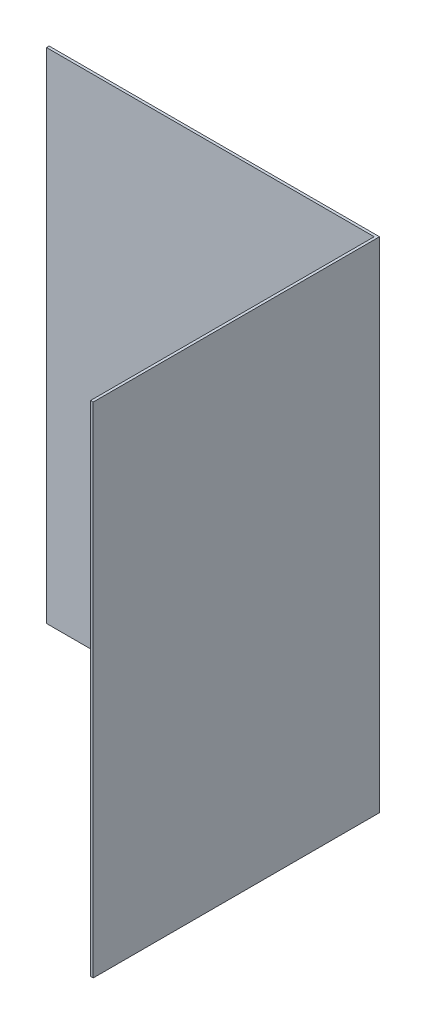
ISO-10303-21;
HEADER;
FILE_DESCRIPTION(('STEP AP214'),'2;1');
FILE_NAME('part.step','',(''),(''),'','','');
FILE_SCHEMA(('AUTOMOTIVE_DESIGN { 1 0 10303 214 1 1 1 1 }'));
ENDSEC;
DATA;
#1=APPLICATION_CONTEXT('core data for automotive mechanical design processes');
#2=APPLICATION_PROTOCOL_DEFINITION('international standard','automotive_design',2000,#1);
#3=PRODUCT_CONTEXT('',#1,'mechanical');
#4=PRODUCT('Part','Part','',(#3));
#5=PRODUCT_RELATED_PRODUCT_CATEGORY('part','',(#4));
#6=PRODUCT_DEFINITION_FORMATION('','',#4);
#7=PRODUCT_DEFINITION_CONTEXT('part definition',#1,'design');
#8=PRODUCT_DEFINITION('design','',#6,#7);
#9=PRODUCT_DEFINITION_SHAPE('','',#8);
#10=(LENGTH_UNIT() NAMED_UNIT(*) SI_UNIT(.MILLI.,.METRE.));
#11=(NAMED_UNIT(*) PLANE_ANGLE_UNIT() SI_UNIT($,.RADIAN.));
#12=(NAMED_UNIT(*) SI_UNIT($,.STERADIAN.) SOLID_ANGLE_UNIT());
#13=UNCERTAINTY_MEASURE_WITH_UNIT(LENGTH_MEASURE(1.E-05),#10,'distance_accuracy_value','');
#14=(GEOMETRIC_REPRESENTATION_CONTEXT(3) GLOBAL_UNCERTAINTY_ASSIGNED_CONTEXT((#13)) GLOBAL_UNIT_ASSIGNED_CONTEXT((#10,
#11,#12)) REPRESENTATION_CONTEXT('',''));
#15=CARTESIAN_POINT('',(0.,0.,0.));
#16=DIRECTION('',(0.,0.,1.));
#17=DIRECTION('',(1.,0.,0.));
#18=AXIS2_PLACEMENT_3D('',#15,#16,#17);
#19=CARTESIAN_POINT('',(0.,0.,0.1524));
#20=DIRECTION('',(0.,0.,1.));
#21=DIRECTION('',(1.,0.,0.));
#22=AXIS2_PLACEMENT_3D('',#19,#20,#21);
#23=PLANE('',#22);
#24=DIRECTION('',(0.,-1.,0.));
#25=VECTOR('',#24,1.);
#26=CARTESIAN_POINT('',(15.7226,14.29385,0.1524));
#27=LINE('',#26,#25);
#28=CARTESIAN_POINT('',(15.7226,14.29385,0.1524));
#29=VERTEX_POINT('',#28);
#30=CARTESIAN_POINT('',(15.7226,-14.4692330285859,0.1524));
#31=VERTEX_POINT('',#30);
#32=EDGE_CURVE('E48',#29,#31,#27,.T.);
#33=ORIENTED_EDGE('',*,*,#32,.F.);
#34=DIRECTION('',(-1.,0.,0.));
#35=VECTOR('',#34,1.);
#36=CARTESIAN_POINT('',(15.875,14.29385,0.1524));
#37=LINE('',#36,#35);
#38=CARTESIAN_POINT('',(-3.175,14.29385,0.1524));
#39=VERTEX_POINT('',#38);
#40=EDGE_CURVE('E86',#29,#39,#37,.T.);
#41=ORIENTED_EDGE('',*,*,#40,.T.);
#42=DIRECTION('',(0.,-1.,0.));
#43=VECTOR('',#42,1.);
#44=CARTESIAN_POINT('',(-3.175,-14.4692330285859,0.1524));
#45=LINE('',#44,#43);
#46=CARTESIAN_POINT('',(-3.175,-14.4692330285859,0.1524));
#47=VERTEX_POINT('',#46);
#48=EDGE_CURVE('E54',#39,#47,#45,.T.);
#49=ORIENTED_EDGE('',*,*,#48,.T.);
#50=DIRECTION('',(1.,0.,0.));
#51=VECTOR('',#50,1.);
#52=CARTESIAN_POINT('',(15.875,-14.4692330285859,0.1524));
#53=LINE('',#52,#51);
#54=EDGE_CURVE('E96',#47,#31,#53,.T.);
#55=ORIENTED_EDGE('',*,*,#54,.T.);
#56=EDGE_LOOP('',(#33,#41,#49,#55));
#57=FACE_BOUND('',#56,.T.);
#58=CARTESIAN_POINT('',(9.525,0.,0.1524));
#59=DIRECTION('',(0.,0.,1.));
#60=DIRECTION('',(1.,0.,0.));
#61=AXIS2_PLACEMENT_3D('',#58,#59,#60);
#62=CIRCLE('',#61,1.5875);
#63=CARTESIAN_POINT('',(11.1125,0.,0.1524));
#64=VERTEX_POINT('',#63);
#65=EDGE_CURVE('E101',#64,#64,#62,.T.);
#66=ORIENTED_EDGE('',*,*,#65,.F.);
#67=EDGE_LOOP('',(#66));
#68=FACE_BOUND('',#67,.T.);
#69=ADVANCED_FACE('F33',(#57,#68),#23,.T.);
#70=CARTESIAN_POINT('',(0.,0.,0.));
#71=DIRECTION('',(0.,0.,1.));
#72=DIRECTION('',(1.,0.,0.));
#73=AXIS2_PLACEMENT_3D('',#70,#71,#72);
#74=PLANE('',#73);
#75=DIRECTION('',(0.,1.,0.));
#76=VECTOR('',#75,1.);
#77=CARTESIAN_POINT('',(15.875,-14.4692330285859,0.));
#78=LINE('',#77,#76);
#79=CARTESIAN_POINT('',(15.875,-14.4692330285859,0.));
#80=VERTEX_POINT('',#79);
#81=CARTESIAN_POINT('',(15.875,14.29385,0.));
#82=VERTEX_POINT('',#81);
#83=EDGE_CURVE('E93',#80,#82,#78,.T.);
#84=ORIENTED_EDGE('',*,*,#83,.F.);
#85=DIRECTION('',(1.,0.,0.));
#86=VECTOR('',#85,1.);
#87=CARTESIAN_POINT('',(15.875,-14.4692330285859,0.));
#88=LINE('',#87,#86);
#89=CARTESIAN_POINT('',(-3.175,-14.4692330285859,0.));
#90=VERTEX_POINT('',#89);
#91=EDGE_CURVE('E74',#90,#80,#88,.T.);
#92=ORIENTED_EDGE('',*,*,#91,.F.);
#93=DIRECTION('',(0.,-1.,0.));
#94=VECTOR('',#93,1.);
#95=CARTESIAN_POINT('',(-3.175,-14.4692330285859,0.));
#96=LINE('',#95,#94);
#97=CARTESIAN_POINT('',(-3.175,14.29385,0.));
#98=VERTEX_POINT('',#97);
#99=EDGE_CURVE('E87',#98,#90,#96,.T.);
#100=ORIENTED_EDGE('',*,*,#99,.F.);
#101=DIRECTION('',(-1.,0.,0.));
#102=VECTOR('',#101,1.);
#103=CARTESIAN_POINT('',(15.875,14.29385,0.));
#104=LINE('',#103,#102);
#105=EDGE_CURVE('E100',#82,#98,#104,.T.);
#106=ORIENTED_EDGE('',*,*,#105,.F.);
#107=EDGE_LOOP('',(#84,#92,#100,#106));
#108=FACE_BOUND('',#107,.T.);
#109=CARTESIAN_POINT('',(9.525,0.,0.));
#110=DIRECTION('',(0.,0.,1.));
#111=DIRECTION('',(1.,0.,0.));
#112=AXIS2_PLACEMENT_3D('',#109,#110,#111);
#113=CIRCLE('',#112,1.5875);
#114=CARTESIAN_POINT('',(11.1125,0.,0.));
#115=VERTEX_POINT('',#114);
#116=EDGE_CURVE('E105',#115,#115,#113,.T.);
#117=ORIENTED_EDGE('',*,*,#116,.T.);
#118=EDGE_LOOP('',(#117));
#119=FACE_BOUND('',#118,.T.);
#120=ADVANCED_FACE('F98',(#108,#119),#74,.F.);
#121=CARTESIAN_POINT('',(15.875,-14.4692330285859,0.1524));
#122=DIRECTION('',(-1.,0.,0.));
#123=DIRECTION('',(0.,0.,1.));
#124=AXIS2_PLACEMENT_3D('',#121,#122,#123);
#125=PLANE('',#124);
#126=ORIENTED_EDGE('',*,*,#83,.T.);
#127=DIRECTION('',(0.,0.,-1.));
#128=VECTOR('',#127,1.);
#129=CARTESIAN_POINT('',(15.875,14.29385,0.1524));
#130=LINE('',#129,#128);
#131=CARTESIAN_POINT('',(15.875,14.29385,16.5097389999976));
#132=VERTEX_POINT('',#131);
#133=EDGE_CURVE('E11',#132,#82,#130,.T.);
#134=ORIENTED_EDGE('',*,*,#133,.F.);
#135=DIRECTION('',(0.,-1.,0.));
#136=VECTOR('',#135,1.);
#137=CARTESIAN_POINT('',(15.875,14.29385,16.5097389999976));
#138=LINE('',#137,#136);
#139=CARTESIAN_POINT('',(15.875,-14.4692330285859,16.5097389999976));
#140=VERTEX_POINT('',#139);
#141=EDGE_CURVE('E95',#132,#140,#138,.T.);
#142=ORIENTED_EDGE('',*,*,#141,.T.);
#143=DIRECTION('',(0.,0.,-1.));
#144=VECTOR('',#143,1.);
#145=CARTESIAN_POINT('',(15.875,-14.4692330285859,0.1524));
#146=LINE('',#145,#144);
#147=EDGE_CURVE('E79',#140,#80,#146,.T.);
#148=ORIENTED_EDGE('',*,*,#147,.T.);
#149=EDGE_LOOP('',(#126,#134,#142,#148));
#150=FACE_BOUND('',#149,.T.);
#151=ADVANCED_FACE('F35',(#150),#125,.F.);
#152=CARTESIAN_POINT('',(15.875,14.29385,0.1524));
#153=DIRECTION('',(0.,-1.,0.));
#154=DIRECTION('',(0.,0.,-1.));
#155=AXIS2_PLACEMENT_3D('',#152,#153,#154);
#156=PLANE('',#155);
#157=ORIENTED_EDGE('',*,*,#105,.T.);
#158=DIRECTION('',(0.,0.,-1.));
#159=VECTOR('',#158,1.);
#160=CARTESIAN_POINT('',(-3.175,14.29385,0.1524));
#161=LINE('',#160,#159);
#162=EDGE_CURVE('E41',#39,#98,#161,.T.);
#163=ORIENTED_EDGE('',*,*,#162,.F.);
#164=ORIENTED_EDGE('',*,*,#40,.F.);
#165=DIRECTION('',(0.,0.,-1.));
#166=VECTOR('',#165,1.);
#167=CARTESIAN_POINT('',(15.7226,14.29385,45.2732257682829));
#168=LINE('',#167,#166);
#169=CARTESIAN_POINT('',(15.7226,14.29385,16.5097389999976));
#170=VERTEX_POINT('',#169);
#171=EDGE_CURVE('E140',#170,#29,#168,.T.);
#172=ORIENTED_EDGE('',*,*,#171,.F.);
#173=DIRECTION('',(1.,0.,0.));
#174=VECTOR('',#173,1.);
#175=CARTESIAN_POINT('',(15.875,14.29385,16.5097389999976));
#176=LINE('',#175,#174);
#177=EDGE_CURVE('E122',#170,#132,#176,.T.);
#178=ORIENTED_EDGE('',*,*,#177,.T.);
#179=ORIENTED_EDGE('',*,*,#133,.T.);
#180=EDGE_LOOP('',(#157,#163,#164,#172,#178,#179));
#181=FACE_BOUND('',#180,.T.);
#182=ADVANCED_FACE('F116',(#181),#156,.F.);
#183=CARTESIAN_POINT('',(-3.175,-14.4692330285859,0.1524));
#184=DIRECTION('',(1.,0.,0.));
#185=DIRECTION('',(0.,0.,-1.));
#186=AXIS2_PLACEMENT_3D('',#183,#184,#185);
#187=PLANE('',#186);
#188=ORIENTED_EDGE('',*,*,#99,.T.);
#189=DIRECTION('',(0.,0.,-1.));
#190=VECTOR('',#189,1.);
#191=CARTESIAN_POINT('',(-3.175,-14.4692330285859,0.1524));
#192=LINE('',#191,#190);
#193=EDGE_CURVE('E82',#47,#90,#192,.T.);
#194=ORIENTED_EDGE('',*,*,#193,.F.);
#195=ORIENTED_EDGE('',*,*,#48,.F.);
#196=ORIENTED_EDGE('',*,*,#162,.T.);
#197=EDGE_LOOP('',(#188,#194,#195,#196));
#198=FACE_BOUND('',#197,.T.);
#199=ADVANCED_FACE('F114',(#198),#187,.F.);
#200=CARTESIAN_POINT('',(15.875,-14.4692330285859,0.1524));
#201=DIRECTION('',(0.,1.,0.));
#202=DIRECTION('',(0.,0.,1.));
#203=AXIS2_PLACEMENT_3D('',#200,#201,#202);
#204=PLANE('',#203);
#205=ORIENTED_EDGE('',*,*,#91,.T.);
#206=ORIENTED_EDGE('',*,*,#147,.F.);
#207=DIRECTION('',(-1.,0.,0.));
#208=VECTOR('',#207,1.);
#209=CARTESIAN_POINT('',(15.875,-14.4692330285859,16.5097389999976));
#210=LINE('',#209,#208);
#211=CARTESIAN_POINT('',(15.7226,-14.4692330285859,16.5097389999976));
#212=VERTEX_POINT('',#211);
#213=EDGE_CURVE('E128',#140,#212,#210,.T.);
#214=ORIENTED_EDGE('',*,*,#213,.T.);
#215=DIRECTION('',(0.,0.,-1.));
#216=VECTOR('',#215,1.);
#217=CARTESIAN_POINT('',(15.7226,-14.4692330285859,45.2732257682829));
#218=LINE('',#217,#216);
#219=EDGE_CURVE('E137',#212,#31,#218,.T.);
#220=ORIENTED_EDGE('',*,*,#219,.T.);
#221=ORIENTED_EDGE('',*,*,#54,.F.);
#222=ORIENTED_EDGE('',*,*,#193,.T.);
#223=EDGE_LOOP('',(#205,#206,#214,#220,#221,#222));
#224=FACE_BOUND('',#223,.T.);
#225=ADVANCED_FACE('F76',(#224),#204,.F.);
#226=CARTESIAN_POINT('',(9.525,0.,0.1524));
#227=DIRECTION('',(0.,0.,-1.));
#228=DIRECTION('',(-1.,0.,0.));
#229=AXIS2_PLACEMENT_3D('',#226,#227,#228);
#230=CYLINDRICAL_SURFACE('',#229,1.5875);
#231=ORIENTED_EDGE('',*,*,#65,.T.);
#232=EDGE_LOOP('',(#231));
#233=FACE_BOUND('',#232,.T.);
#234=ORIENTED_EDGE('',*,*,#116,.F.);
#235=EDGE_LOOP('',(#234));
#236=FACE_BOUND('',#235,.T.);
#237=ADVANCED_FACE('F153',(#233,#236),#230,.F.);
#238=CARTESIAN_POINT('',(15.7226,14.29385,45.2732257682829));
#239=DIRECTION('',(1.,0.,0.));
#240=DIRECTION('',(0.,1.,0.));
#241=AXIS2_PLACEMENT_3D('',#238,#239,#240);
#242=PLANE('',#241);
#243=ORIENTED_EDGE('',*,*,#219,.F.);
#244=DIRECTION('',(0.,1.,0.));
#245=VECTOR('',#244,1.);
#246=CARTESIAN_POINT('',(15.7226,14.29385,16.5097389999976));
#247=LINE('',#246,#245);
#248=EDGE_CURVE('E132',#212,#170,#247,.T.);
#249=ORIENTED_EDGE('',*,*,#248,.T.);
#250=ORIENTED_EDGE('',*,*,#171,.T.);
#251=ORIENTED_EDGE('',*,*,#32,.T.);
#252=EDGE_LOOP('',(#243,#249,#250,#251));
#253=FACE_BOUND('',#252,.T.);
#254=ADVANCED_FACE('F149',(#253),#242,.F.);
#255=CARTESIAN_POINT('',(15.875,31.4018379999927,16.5097389999976));
#256=DIRECTION('',(0.,0.,-1.));
#257=DIRECTION('',(0.,-1.,0.));
#258=AXIS2_PLACEMENT_3D('',#255,#256,#257);
#259=PLANE('',#258);
#260=ORIENTED_EDGE('',*,*,#177,.F.);
#261=ORIENTED_EDGE('',*,*,#248,.F.);
#262=ORIENTED_EDGE('',*,*,#213,.F.);
#263=ORIENTED_EDGE('',*,*,#141,.F.);
#264=EDGE_LOOP('',(#260,#261,#262,#263));
#265=FACE_BOUND('',#264,.T.);
#266=ADVANCED_FACE('F126',(#265),#259,.F.);
#267=CLOSED_SHELL('',(#69,#120,#151,#182,#199,#225,#237,#254,#266));
#268=MANIFOLD_SOLID_BREP('B2',#267);
#269=ADVANCED_BREP_SHAPE_REPRESENTATION('',(#18,#268),#14);
#270=SHAPE_DEFINITION_REPRESENTATION(#9,#269);
ENDSEC;
END-ISO-10303-21;
